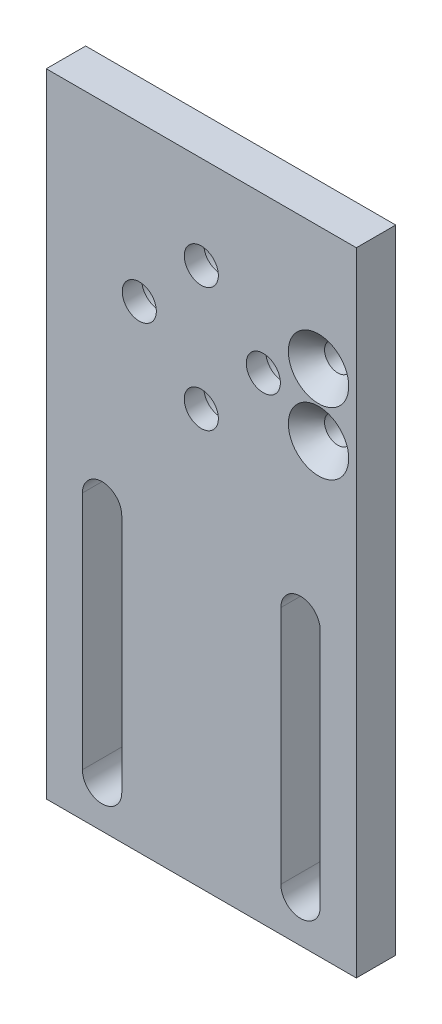
ISO-10303-21;
HEADER;
FILE_DESCRIPTION(('STEP AP214'),'2;1');
FILE_NAME('part.step','',(''),(''),'','','');
FILE_SCHEMA(('AUTOMOTIVE_DESIGN { 1 0 10303 214 1 1 1 1 }'));
ENDSEC;
DATA;
#1=APPLICATION_CONTEXT('core data for automotive mechanical design processes');
#2=APPLICATION_PROTOCOL_DEFINITION('international standard','automotive_design',2000,#1);
#3=PRODUCT_CONTEXT('',#1,'mechanical');
#4=PRODUCT('Part','Part','',(#3));
#5=PRODUCT_RELATED_PRODUCT_CATEGORY('part','',(#4));
#6=PRODUCT_DEFINITION_FORMATION('','',#4);
#7=PRODUCT_DEFINITION_CONTEXT('part definition',#1,'design');
#8=PRODUCT_DEFINITION('design','',#6,#7);
#9=PRODUCT_DEFINITION_SHAPE('','',#8);
#10=(LENGTH_UNIT() NAMED_UNIT(*) SI_UNIT(.MILLI.,.METRE.));
#11=(NAMED_UNIT(*) PLANE_ANGLE_UNIT() SI_UNIT($,.RADIAN.));
#12=(NAMED_UNIT(*) SI_UNIT($,.STERADIAN.) SOLID_ANGLE_UNIT());
#13=UNCERTAINTY_MEASURE_WITH_UNIT(LENGTH_MEASURE(1.E-05),#10,'distance_accuracy_value','');
#14=(GEOMETRIC_REPRESENTATION_CONTEXT(3) GLOBAL_UNCERTAINTY_ASSIGNED_CONTEXT((#13)) GLOBAL_UNIT_ASSIGNED_CONTEXT((#10,
#11,#12)) REPRESENTATION_CONTEXT('',''));
#15=CARTESIAN_POINT('',(0.,0.,0.));
#16=DIRECTION('',(0.,0.,1.));
#17=DIRECTION('',(1.,0.,0.));
#18=AXIS2_PLACEMENT_3D('',#15,#16,#17);
#19=CARTESIAN_POINT('',(-16.002,-69.9897,6.35));
#20=DIRECTION('',(0.,0.,-1.));
#21=DIRECTION('',(-1.,0.,0.));
#22=AXIS2_PLACEMENT_3D('',#19,#20,#21);
#23=CYLINDRICAL_SURFACE('',#22,3.175);
#24=CARTESIAN_POINT('',(-16.002,-69.9897,0.));
#25=DIRECTION('',(0.,0.,1.));
#26=DIRECTION('',(1.,0.,0.));
#27=AXIS2_PLACEMENT_3D('',#24,#25,#26);
#28=CIRCLE('',#27,3.175);
#29=CARTESIAN_POINT('',(-19.177,-69.9897,0.));
#30=VERTEX_POINT('',#29);
#31=CARTESIAN_POINT('',(-12.827,-69.9897,0.));
#32=VERTEX_POINT('',#31);
#33=EDGE_CURVE('E179',#30,#32,#28,.T.);
#34=ORIENTED_EDGE('',*,*,#33,.F.);
#35=DIRECTION('',(0.,0.,-1.));
#36=VECTOR('',#35,1.);
#37=CARTESIAN_POINT('',(-19.177,-69.9897,6.35));
#38=LINE('',#37,#36);
#39=CARTESIAN_POINT('',(-19.177,-69.9897,6.35));
#40=VERTEX_POINT('',#39);
#41=EDGE_CURVE('E11',#40,#30,#38,.T.);
#42=ORIENTED_EDGE('',*,*,#41,.F.);
#43=CARTESIAN_POINT('',(-16.002,-69.9897,6.35));
#44=DIRECTION('',(0.,0.,1.));
#45=DIRECTION('',(1.,0.,0.));
#46=AXIS2_PLACEMENT_3D('',#43,#44,#45);
#47=CIRCLE('',#46,3.175);
#48=CARTESIAN_POINT('',(-12.827,-69.9897,6.35));
#49=VERTEX_POINT('',#48);
#50=EDGE_CURVE('E148',#40,#49,#47,.T.);
#51=ORIENTED_EDGE('',*,*,#50,.T.);
#52=DIRECTION('',(0.,0.,-1.));
#53=VECTOR('',#52,1.);
#54=CARTESIAN_POINT('',(-12.827,-69.9897,6.35));
#55=LINE('',#54,#53);
#56=EDGE_CURVE('E101',#49,#32,#55,.T.);
#57=ORIENTED_EDGE('',*,*,#56,.T.);
#58=EDGE_LOOP('',(#34,#42,#51,#57));
#59=FACE_BOUND('',#58,.T.);
#60=ADVANCED_FACE('F36',(#59),#23,.F.);
#61=CARTESIAN_POINT('',(-19.177,0.,6.35));
#62=DIRECTION('',(1.,0.,0.));
#63=DIRECTION('',(0.,1.,0.));
#64=AXIS2_PLACEMENT_3D('',#61,#62,#63);
#65=PLANE('',#64);
#66=DIRECTION('',(0.,-1.,0.));
#67=VECTOR('',#66,1.);
#68=CARTESIAN_POINT('',(-19.177,0.,0.));
#69=LINE('',#68,#67);
#70=CARTESIAN_POINT('',(-19.177,-31.341450548398,0.));
#71=VERTEX_POINT('',#70);
#72=EDGE_CURVE('E140',#71,#30,#69,.T.);
#73=ORIENTED_EDGE('',*,*,#72,.F.);
#74=DIRECTION('',(0.,0.,-1.));
#75=VECTOR('',#74,1.);
#76=CARTESIAN_POINT('',(-19.177,-31.341450548398,6.35));
#77=LINE('',#76,#75);
#78=CARTESIAN_POINT('',(-19.177,-31.341450548398,6.35));
#79=VERTEX_POINT('',#78);
#80=EDGE_CURVE('E46',#79,#71,#77,.T.);
#81=ORIENTED_EDGE('',*,*,#80,.F.);
#82=DIRECTION('',(0.,-1.,0.));
#83=VECTOR('',#82,1.);
#84=CARTESIAN_POINT('',(-19.177,0.,6.35));
#85=LINE('',#84,#83);
#86=EDGE_CURVE('E138',#79,#40,#85,.T.);
#87=ORIENTED_EDGE('',*,*,#86,.T.);
#88=ORIENTED_EDGE('',*,*,#41,.T.);
#89=EDGE_LOOP('',(#73,#81,#87,#88));
#90=FACE_BOUND('',#89,.T.);
#91=ADVANCED_FACE('F137',(#90),#65,.T.);
#92=CARTESIAN_POINT('',(-16.002,-31.341450548398,6.35));
#93=DIRECTION('',(0.,0.,-1.));
#94=DIRECTION('',(-1.,0.,0.));
#95=AXIS2_PLACEMENT_3D('',#92,#93,#94);
#96=CYLINDRICAL_SURFACE('',#95,3.175);
#97=CARTESIAN_POINT('',(-16.002,-31.341450548398,0.));
#98=DIRECTION('',(0.,0.,1.));
#99=DIRECTION('',(1.,0.,0.));
#100=AXIS2_PLACEMENT_3D('',#97,#98,#99);
#101=CIRCLE('',#100,3.175);
#102=CARTESIAN_POINT('',(-12.827,-31.341450548398,0.));
#103=VERTEX_POINT('',#102);
#104=EDGE_CURVE('E183',#103,#71,#101,.T.);
#105=ORIENTED_EDGE('',*,*,#104,.F.);
#106=DIRECTION('',(0.,0.,-1.));
#107=VECTOR('',#106,1.);
#108=CARTESIAN_POINT('',(-12.827,-31.341450548398,6.35));
#109=LINE('',#108,#107);
#110=CARTESIAN_POINT('',(-12.827,-31.341450548398,6.35));
#111=VERTEX_POINT('',#110);
#112=EDGE_CURVE('E94',#111,#103,#109,.T.);
#113=ORIENTED_EDGE('',*,*,#112,.F.);
#114=CARTESIAN_POINT('',(-16.002,-31.341450548398,6.35));
#115=DIRECTION('',(0.,0.,1.));
#116=DIRECTION('',(1.,0.,0.));
#117=AXIS2_PLACEMENT_3D('',#114,#115,#116);
#118=CIRCLE('',#117,3.175);
#119=EDGE_CURVE('E147',#111,#79,#118,.T.);
#120=ORIENTED_EDGE('',*,*,#119,.T.);
#121=ORIENTED_EDGE('',*,*,#80,.T.);
#122=EDGE_LOOP('',(#105,#113,#120,#121));
#123=FACE_BOUND('',#122,.T.);
#124=ADVANCED_FACE('F150',(#123),#96,.F.);
#125=CARTESIAN_POINT('',(16.002,-69.9897,6.35));
#126=DIRECTION('',(0.,0.,-1.));
#127=DIRECTION('',(-1.,0.,0.));
#128=AXIS2_PLACEMENT_3D('',#125,#126,#127);
#129=CYLINDRICAL_SURFACE('',#128,3.175);
#130=CARTESIAN_POINT('',(16.002,-69.9897,0.));
#131=DIRECTION('',(0.,0.,1.));
#132=DIRECTION('',(1.,0.,0.));
#133=AXIS2_PLACEMENT_3D('',#130,#131,#132);
#134=CIRCLE('',#133,3.175);
#135=CARTESIAN_POINT('',(12.827,-69.9897,0.));
#136=VERTEX_POINT('',#135);
#137=CARTESIAN_POINT('',(19.177,-69.9897,0.));
#138=VERTEX_POINT('',#137);
#139=EDGE_CURVE('E167',#136,#138,#134,.T.);
#140=ORIENTED_EDGE('',*,*,#139,.F.);
#141=DIRECTION('',(0.,0.,-1.));
#142=VECTOR('',#141,1.);
#143=CARTESIAN_POINT('',(12.827,-69.9897,6.35));
#144=LINE('',#143,#142);
#145=CARTESIAN_POINT('',(12.827,-69.9897,6.35));
#146=VERTEX_POINT('',#145);
#147=EDGE_CURVE('E189',#146,#136,#144,.T.);
#148=ORIENTED_EDGE('',*,*,#147,.F.);
#149=CARTESIAN_POINT('',(16.002,-69.9897,6.35));
#150=DIRECTION('',(0.,0.,1.));
#151=DIRECTION('',(1.,0.,0.));
#152=AXIS2_PLACEMENT_3D('',#149,#150,#151);
#153=CIRCLE('',#152,3.175);
#154=CARTESIAN_POINT('',(19.177,-69.9897,6.35));
#155=VERTEX_POINT('',#154);
#156=EDGE_CURVE('E226',#146,#155,#153,.T.);
#157=ORIENTED_EDGE('',*,*,#156,.T.);
#158=DIRECTION('',(0.,0.,-1.));
#159=VECTOR('',#158,1.);
#160=CARTESIAN_POINT('',(19.177,-69.9897,6.35));
#161=LINE('',#160,#159);
#162=EDGE_CURVE('E191',#155,#138,#161,.T.);
#163=ORIENTED_EDGE('',*,*,#162,.T.);
#164=EDGE_LOOP('',(#140,#148,#157,#163));
#165=FACE_BOUND('',#164,.T.);
#166=ADVANCED_FACE('F271',(#165),#129,.F.);
#167=CARTESIAN_POINT('',(12.827,0.,6.35));
#168=DIRECTION('',(1.,0.,0.));
#169=DIRECTION('',(0.,1.,0.));
#170=AXIS2_PLACEMENT_3D('',#167,#168,#169);
#171=PLANE('',#170);
#172=DIRECTION('',(0.,-1.,0.));
#173=VECTOR('',#172,1.);
#174=CARTESIAN_POINT('',(12.827,0.,0.));
#175=LINE('',#174,#173);
#176=CARTESIAN_POINT('',(12.827,-31.341450548398,0.));
#177=VERTEX_POINT('',#176);
#178=EDGE_CURVE('E170',#177,#136,#175,.T.);
#179=ORIENTED_EDGE('',*,*,#178,.F.);
#180=DIRECTION('',(0.,0.,-1.));
#181=VECTOR('',#180,1.);
#182=CARTESIAN_POINT('',(12.827,-31.341450548398,6.35));
#183=LINE('',#182,#181);
#184=CARTESIAN_POINT('',(12.827,-31.341450548398,6.35));
#185=VERTEX_POINT('',#184);
#186=EDGE_CURVE('E195',#185,#177,#183,.T.);
#187=ORIENTED_EDGE('',*,*,#186,.F.);
#188=DIRECTION('',(0.,-1.,0.));
#189=VECTOR('',#188,1.);
#190=CARTESIAN_POINT('',(12.827,0.,6.35));
#191=LINE('',#190,#189);
#192=EDGE_CURVE('E233',#185,#146,#191,.T.);
#193=ORIENTED_EDGE('',*,*,#192,.T.);
#194=ORIENTED_EDGE('',*,*,#147,.T.);
#195=EDGE_LOOP('',(#179,#187,#193,#194));
#196=FACE_BOUND('',#195,.T.);
#197=ADVANCED_FACE('F267',(#196),#171,.T.);
#198=CARTESIAN_POINT('',(16.002,-31.341450548398,6.35));
#199=DIRECTION('',(0.,0.,-1.));
#200=DIRECTION('',(-1.,0.,0.));
#201=AXIS2_PLACEMENT_3D('',#198,#199,#200);
#202=CYLINDRICAL_SURFACE('',#201,3.175);
#203=CARTESIAN_POINT('',(16.002,-31.341450548398,0.));
#204=DIRECTION('',(0.,0.,1.));
#205=DIRECTION('',(1.,0.,0.));
#206=AXIS2_PLACEMENT_3D('',#203,#204,#205);
#207=CIRCLE('',#206,3.175);
#208=CARTESIAN_POINT('',(19.177,-31.341450548398,0.));
#209=VERTEX_POINT('',#208);
#210=EDGE_CURVE('E173',#209,#177,#207,.T.);
#211=ORIENTED_EDGE('',*,*,#210,.F.);
#212=DIRECTION('',(0.,0.,-1.));
#213=VECTOR('',#212,1.);
#214=CARTESIAN_POINT('',(19.177,-31.341450548398,6.35));
#215=LINE('',#214,#213);
#216=CARTESIAN_POINT('',(19.177,-31.341450548398,6.35));
#217=VERTEX_POINT('',#216);
#218=EDGE_CURVE('E193',#217,#209,#215,.T.);
#219=ORIENTED_EDGE('',*,*,#218,.F.);
#220=CARTESIAN_POINT('',(16.002,-31.341450548398,6.35));
#221=DIRECTION('',(0.,0.,1.));
#222=DIRECTION('',(1.,0.,0.));
#223=AXIS2_PLACEMENT_3D('',#220,#221,#222);
#224=CIRCLE('',#223,3.175);
#225=EDGE_CURVE('E236',#217,#185,#224,.T.);
#226=ORIENTED_EDGE('',*,*,#225,.T.);
#227=ORIENTED_EDGE('',*,*,#186,.T.);
#228=EDGE_LOOP('',(#211,#219,#226,#227));
#229=FACE_BOUND('',#228,.T.);
#230=ADVANCED_FACE('F264',(#229),#202,.F.);
#231=CARTESIAN_POINT('',(-24.9999999999998,0.,6.35));
#232=DIRECTION('',(-1.,0.,0.));
#233=DIRECTION('',(0.,0.,1.));
#234=AXIS2_PLACEMENT_3D('',#231,#232,#233);
#235=PLANE('',#234);
#236=DIRECTION('',(0.,1.,0.));
#237=VECTOR('',#236,1.);
#238=CARTESIAN_POINT('',(-24.9999999999998,0.,0.));
#239=LINE('',#238,#237);
#240=CARTESIAN_POINT('',(-24.9999999999998,-76.9874,0.));
#241=VERTEX_POINT('',#240);
#242=CARTESIAN_POINT('',(-24.9999999999998,25.0000000000001,0.));
#243=VERTEX_POINT('',#242);
#244=EDGE_CURVE('E156',#241,#243,#239,.T.);
#245=ORIENTED_EDGE('',*,*,#244,.F.);
#246=DIRECTION('',(0.,0.,-1.));
#247=VECTOR('',#246,1.);
#248=CARTESIAN_POINT('',(-24.9999999999998,-76.9874,6.35));
#249=LINE('',#248,#247);
#250=CARTESIAN_POINT('',(-24.9999999999998,-76.9874,6.35));
#251=VERTEX_POINT('',#250);
#252=EDGE_CURVE('E40',#251,#241,#249,.T.);
#253=ORIENTED_EDGE('',*,*,#252,.F.);
#254=DIRECTION('',(0.,1.,0.));
#255=VECTOR('',#254,1.);
#256=CARTESIAN_POINT('',(-24.9999999999998,0.,6.35));
#257=LINE('',#256,#255);
#258=CARTESIAN_POINT('',(-24.9999999999998,25.0000000000001,6.35));
#259=VERTEX_POINT('',#258);
#260=EDGE_CURVE('E187',#251,#259,#257,.T.);
#261=ORIENTED_EDGE('',*,*,#260,.T.);
#262=DIRECTION('',(0.,0.,-1.));
#263=VECTOR('',#262,1.);
#264=CARTESIAN_POINT('',(-24.9999999999998,25.0000000000001,6.35));
#265=LINE('',#264,#263);
#266=EDGE_CURVE('E152',#259,#243,#265,.T.);
#267=ORIENTED_EDGE('',*,*,#266,.T.);
#268=EDGE_LOOP('',(#245,#253,#261,#267));
#269=FACE_BOUND('',#268,.T.);
#270=ADVANCED_FACE('F38',(#269),#235,.T.);
#271=CARTESIAN_POINT('',(0.,-76.9874,6.35));
#272=DIRECTION('',(0.,1.,0.));
#273=DIRECTION('',(0.,0.,1.));
#274=AXIS2_PLACEMENT_3D('',#271,#272,#273);
#275=PLANE('',#274);
#276=DIRECTION('',(1.,0.,0.));
#277=VECTOR('',#276,1.);
#278=CARTESIAN_POINT('',(0.,-76.9874,0.));
#279=LINE('',#278,#277);
#280=CARTESIAN_POINT('',(25.0000000000002,-76.9874,0.));
#281=VERTEX_POINT('',#280);
#282=EDGE_CURVE('E159',#241,#281,#279,.T.);
#283=ORIENTED_EDGE('',*,*,#282,.T.);
#284=DIRECTION('',(0.,0.,-1.));
#285=VECTOR('',#284,1.);
#286=CARTESIAN_POINT('',(25.0000000000002,-76.9874,6.35));
#287=LINE('',#286,#285);
#288=CARTESIAN_POINT('',(25.0000000000002,-76.9874,6.35));
#289=VERTEX_POINT('',#288);
#290=EDGE_CURVE('E201',#289,#281,#287,.T.);
#291=ORIENTED_EDGE('',*,*,#290,.F.);
#292=DIRECTION('',(1.,0.,0.));
#293=VECTOR('',#292,1.);
#294=CARTESIAN_POINT('',(0.,-76.9874,6.35));
#295=LINE('',#294,#293);
#296=EDGE_CURVE('E210',#251,#289,#295,.T.);
#297=ORIENTED_EDGE('',*,*,#296,.F.);
#298=ORIENTED_EDGE('',*,*,#252,.T.);
#299=EDGE_LOOP('',(#283,#291,#297,#298));
#300=FACE_BOUND('',#299,.T.);
#301=ADVANCED_FACE('F209',(#300),#275,.F.);
#302=CARTESIAN_POINT('',(25.0000000000002,0.,6.35));
#303=DIRECTION('',(-1.,0.,0.));
#304=DIRECTION('',(0.,0.,1.));
#305=AXIS2_PLACEMENT_3D('',#302,#303,#304);
#306=PLANE('',#305);
#307=DIRECTION('',(0.,1.,0.));
#308=VECTOR('',#307,1.);
#309=CARTESIAN_POINT('',(25.0000000000002,0.,0.));
#310=LINE('',#309,#308);
#311=CARTESIAN_POINT('',(25.0000000000002,25.0000000000002,0.));
#312=VERTEX_POINT('',#311);
#313=EDGE_CURVE('E162',#281,#312,#310,.T.);
#314=ORIENTED_EDGE('',*,*,#313,.T.);
#315=DIRECTION('',(0.,0.,-1.));
#316=VECTOR('',#315,1.);
#317=CARTESIAN_POINT('',(25.0000000000002,25.0000000000002,6.35));
#318=LINE('',#317,#316);
#319=CARTESIAN_POINT('',(25.0000000000002,25.0000000000002,6.35));
#320=VERTEX_POINT('',#319);
#321=EDGE_CURVE('E199',#320,#312,#318,.T.);
#322=ORIENTED_EDGE('',*,*,#321,.F.);
#323=DIRECTION('',(0.,1.,0.));
#324=VECTOR('',#323,1.);
#325=CARTESIAN_POINT('',(25.0000000000002,0.,6.35));
#326=LINE('',#325,#324);
#327=EDGE_CURVE('E223',#289,#320,#326,.T.);
#328=ORIENTED_EDGE('',*,*,#327,.F.);
#329=ORIENTED_EDGE('',*,*,#290,.T.);
#330=EDGE_LOOP('',(#314,#322,#328,#329));
#331=FACE_BOUND('',#330,.T.);
#332=ADVANCED_FACE('F222',(#331),#306,.F.);
#333=CARTESIAN_POINT('',(19.177,0.,6.35));
#334=DIRECTION('',(1.,0.,0.));
#335=DIRECTION('',(0.,1.,0.));
#336=AXIS2_PLACEMENT_3D('',#333,#334,#335);
#337=PLANE('',#336);
#338=DIRECTION('',(0.,-1.,0.));
#339=VECTOR('',#338,1.);
#340=CARTESIAN_POINT('',(19.177,0.,0.));
#341=LINE('',#340,#339);
#342=EDGE_CURVE('E176',#209,#138,#341,.T.);
#343=ORIENTED_EDGE('',*,*,#342,.T.);
#344=ORIENTED_EDGE('',*,*,#162,.F.);
#345=DIRECTION('',(0.,-1.,0.));
#346=VECTOR('',#345,1.);
#347=CARTESIAN_POINT('',(19.177,0.,6.35));
#348=LINE('',#347,#346);
#349=EDGE_CURVE('E239',#217,#155,#348,.T.);
#350=ORIENTED_EDGE('',*,*,#349,.F.);
#351=ORIENTED_EDGE('',*,*,#218,.T.);
#352=EDGE_LOOP('',(#343,#344,#350,#351));
#353=FACE_BOUND('',#352,.T.);
#354=ADVANCED_FACE('F250',(#353),#337,.F.);
#355=CARTESIAN_POINT('',(0.,25.0000000000002,6.35));
#356=DIRECTION('',(0.,-1.,0.));
#357=DIRECTION('',(1.,0.,0.));
#358=AXIS2_PLACEMENT_3D('',#355,#356,#357);
#359=PLANE('',#358);
#360=DIRECTION('',(-1.,0.,0.));
#361=VECTOR('',#360,1.);
#362=CARTESIAN_POINT('',(0.,25.0000000000002,0.));
#363=LINE('',#362,#361);
#364=EDGE_CURVE('E164',#312,#243,#363,.T.);
#365=ORIENTED_EDGE('',*,*,#364,.T.);
#366=ORIENTED_EDGE('',*,*,#266,.F.);
#367=DIRECTION('',(-1.,0.,0.));
#368=VECTOR('',#367,1.);
#369=CARTESIAN_POINT('',(0.,25.0000000000002,6.35));
#370=LINE('',#369,#368);
#371=EDGE_CURVE('E221',#320,#259,#370,.T.);
#372=ORIENTED_EDGE('',*,*,#371,.F.);
#373=ORIENTED_EDGE('',*,*,#321,.T.);
#374=EDGE_LOOP('',(#365,#366,#372,#373));
#375=FACE_BOUND('',#374,.T.);
#376=ADVANCED_FACE('F219',(#375),#359,.F.);
#377=CARTESIAN_POINT('',(-12.827,0.,6.35));
#378=DIRECTION('',(1.,0.,0.));
#379=DIRECTION('',(0.,1.,0.));
#380=AXIS2_PLACEMENT_3D('',#377,#378,#379);
#381=PLANE('',#380);
#382=DIRECTION('',(0.,-1.,0.));
#383=VECTOR('',#382,1.);
#384=CARTESIAN_POINT('',(-12.827,0.,0.));
#385=LINE('',#384,#383);
#386=EDGE_CURVE('E185',#103,#32,#385,.T.);
#387=ORIENTED_EDGE('',*,*,#386,.T.);
#388=ORIENTED_EDGE('',*,*,#56,.F.);
#389=DIRECTION('',(0.,-1.,0.));
#390=VECTOR('',#389,1.);
#391=CARTESIAN_POINT('',(-12.827,0.,6.35));
#392=LINE('',#391,#390);
#393=EDGE_CURVE('E55',#111,#49,#392,.T.);
#394=ORIENTED_EDGE('',*,*,#393,.F.);
#395=ORIENTED_EDGE('',*,*,#112,.T.);
#396=EDGE_LOOP('',(#387,#388,#394,#395));
#397=FACE_BOUND('',#396,.T.);
#398=ADVANCED_FACE('F241',(#397),#381,.F.);
#399=CARTESIAN_POINT('',(0.,0.,6.35));
#400=DIRECTION('',(0.,0.,1.));
#401=DIRECTION('',(1.,0.,0.));
#402=AXIS2_PLACEMENT_3D('',#399,#400,#401);
#403=PLANE('',#402);
#404=CARTESIAN_POINT('',(0.,10.,6.35));
#405=DIRECTION('',(0.,0.,-1.));
#406=DIRECTION('',(-1.,0.,0.));
#407=AXIS2_PLACEMENT_3D('',#404,#405,#406);
#408=CIRCLE('',#407,2.75);
#409=CARTESIAN_POINT('',(-2.75,10.,6.35));
#410=VERTEX_POINT('',#409);
#411=EDGE_CURVE('E544',#410,#410,#408,.T.);
#412=ORIENTED_EDGE('',*,*,#411,.T.);
#413=EDGE_LOOP('',(#412));
#414=FACE_BOUND('',#413,.T.);
#415=CARTESIAN_POINT('',(10.,0.,6.35));
#416=DIRECTION('',(0.,0.,-1.));
#417=DIRECTION('',(-1.,0.,0.));
#418=AXIS2_PLACEMENT_3D('',#415,#416,#417);
#419=CIRCLE('',#418,2.75);
#420=CARTESIAN_POINT('',(7.25,0.,6.35));
#421=VERTEX_POINT('',#420);
#422=EDGE_CURVE('E556',#421,#421,#419,.T.);
#423=ORIENTED_EDGE('',*,*,#422,.T.);
#424=EDGE_LOOP('',(#423));
#425=FACE_BOUND('',#424,.T.);
#426=CARTESIAN_POINT('',(0.,-10.,6.35));
#427=DIRECTION('',(0.,0.,-1.));
#428=DIRECTION('',(-1.,0.,0.));
#429=AXIS2_PLACEMENT_3D('',#426,#427,#428);
#430=CIRCLE('',#429,2.75);
#431=CARTESIAN_POINT('',(-2.75,-10.,6.35));
#432=VERTEX_POINT('',#431);
#433=EDGE_CURVE('E568',#432,#432,#430,.T.);
#434=ORIENTED_EDGE('',*,*,#433,.T.);
#435=EDGE_LOOP('',(#434));
#436=FACE_BOUND('',#435,.T.);
#437=CARTESIAN_POINT('',(-10.,0.,6.35));
#438=DIRECTION('',(0.,0.,-1.));
#439=DIRECTION('',(-1.,0.,0.));
#440=AXIS2_PLACEMENT_3D('',#437,#438,#439);
#441=CIRCLE('',#440,2.75);
#442=CARTESIAN_POINT('',(-12.75,0.,6.35));
#443=VERTEX_POINT('',#442);
#444=EDGE_CURVE('E580',#443,#443,#441,.T.);
#445=ORIENTED_EDGE('',*,*,#444,.T.);
#446=EDGE_LOOP('',(#445));
#447=FACE_BOUND('',#446,.T.);
#448=CARTESIAN_POINT('',(18.9040000000002,5.04825,6.35));
#449=DIRECTION('',(0.,0.,1.));
#450=DIRECTION('',(1.,0.,0.));
#451=AXIS2_PLACEMENT_3D('',#448,#449,#450);
#452=CIRCLE('',#451,4.8680878);
#453=CARTESIAN_POINT('',(23.7720878000002,5.04825,6.35));
#454=VERTEX_POINT('',#453);
#455=EDGE_CURVE('E583',#454,#454,#452,.T.);
#456=ORIENTED_EDGE('',*,*,#455,.F.);
#457=EDGE_LOOP('',(#456));
#458=FACE_BOUND('',#457,.T.);
#459=CARTESIAN_POINT('',(18.9040000000002,-5.04825,6.35));
#460=DIRECTION('',(0.,0.,1.));
#461=DIRECTION('',(1.,0.,0.));
#462=AXIS2_PLACEMENT_3D('',#459,#460,#461);
#463=CIRCLE('',#462,4.8680878);
#464=CARTESIAN_POINT('',(23.7720878000002,-5.04825,6.35));
#465=VERTEX_POINT('',#464);
#466=EDGE_CURVE('E592',#465,#465,#463,.T.);
#467=ORIENTED_EDGE('',*,*,#466,.F.);
#468=EDGE_LOOP('',(#467));
#469=FACE_BOUND('',#468,.T.);
#470=ORIENTED_EDGE('',*,*,#260,.F.);
#471=ORIENTED_EDGE('',*,*,#296,.T.);
#472=ORIENTED_EDGE('',*,*,#327,.T.);
#473=ORIENTED_EDGE('',*,*,#371,.T.);
#474=EDGE_LOOP('',(#470,#471,#472,#473));
#475=FACE_BOUND('',#474,.T.);
#476=ORIENTED_EDGE('',*,*,#156,.F.);
#477=ORIENTED_EDGE('',*,*,#192,.F.);
#478=ORIENTED_EDGE('',*,*,#225,.F.);
#479=ORIENTED_EDGE('',*,*,#349,.T.);
#480=EDGE_LOOP('',(#476,#477,#478,#479));
#481=FACE_BOUND('',#480,.T.);
#482=ORIENTED_EDGE('',*,*,#50,.F.);
#483=ORIENTED_EDGE('',*,*,#86,.F.);
#484=ORIENTED_EDGE('',*,*,#119,.F.);
#485=ORIENTED_EDGE('',*,*,#393,.T.);
#486=EDGE_LOOP('',(#482,#483,#484,#485));
#487=FACE_BOUND('',#486,.T.);
#488=ADVANCED_FACE('F146',(#414,#425,#436,#447,#458,#469,#475,#481,#487),#403,.T.);
#489=CARTESIAN_POINT('',(0.,0.,0.));
#490=DIRECTION('',(0.,0.,1.));
#491=DIRECTION('',(1.,0.,0.));
#492=AXIS2_PLACEMENT_3D('',#489,#490,#491);
#493=PLANE('',#492);
#494=CARTESIAN_POINT('',(0.,10.,0.));
#495=DIRECTION('',(0.,0.,-1.));
#496=DIRECTION('',(-1.,0.,0.));
#497=AXIS2_PLACEMENT_3D('',#494,#495,#496);
#498=CIRCLE('',#497,4.99999999999999);
#499=CARTESIAN_POINT('',(-4.99999999999999,10.,0.));
#500=VERTEX_POINT('',#499);
#501=EDGE_CURVE('E537',#500,#500,#498,.T.);
#502=ORIENTED_EDGE('',*,*,#501,.F.);
#503=EDGE_LOOP('',(#502));
#504=FACE_BOUND('',#503,.T.);
#505=CARTESIAN_POINT('',(10.,0.,0.));
#506=DIRECTION('',(0.,0.,-1.));
#507=DIRECTION('',(-1.,0.,0.));
#508=AXIS2_PLACEMENT_3D('',#505,#506,#507);
#509=CIRCLE('',#508,4.99999999999999);
#510=CARTESIAN_POINT('',(5.,0.,0.));
#511=VERTEX_POINT('',#510);
#512=EDGE_CURVE('E547',#511,#511,#509,.T.);
#513=ORIENTED_EDGE('',*,*,#512,.F.);
#514=EDGE_LOOP('',(#513));
#515=FACE_BOUND('',#514,.T.);
#516=CARTESIAN_POINT('',(0.,-10.,0.));
#517=DIRECTION('',(0.,0.,-1.));
#518=DIRECTION('',(-1.,0.,0.));
#519=AXIS2_PLACEMENT_3D('',#516,#517,#518);
#520=CIRCLE('',#519,4.99999999999999);
#521=CARTESIAN_POINT('',(-5.,-10.,0.));
#522=VERTEX_POINT('',#521);
#523=EDGE_CURVE('E559',#522,#522,#520,.T.);
#524=ORIENTED_EDGE('',*,*,#523,.F.);
#525=EDGE_LOOP('',(#524));
#526=FACE_BOUND('',#525,.T.);
#527=CARTESIAN_POINT('',(-10.,0.,0.));
#528=DIRECTION('',(0.,0.,-1.));
#529=DIRECTION('',(-1.,0.,0.));
#530=AXIS2_PLACEMENT_3D('',#527,#528,#529);
#531=CIRCLE('',#530,4.99999999999999);
#532=CARTESIAN_POINT('',(-15.,0.,0.));
#533=VERTEX_POINT('',#532);
#534=EDGE_CURVE('E571',#533,#533,#531,.T.);
#535=ORIENTED_EDGE('',*,*,#534,.F.);
#536=EDGE_LOOP('',(#535));
#537=FACE_BOUND('',#536,.T.);
#538=CARTESIAN_POINT('',(18.9040000000002,5.04825,0.));
#539=DIRECTION('',(0.,0.,1.));
#540=DIRECTION('',(1.,0.,0.));
#541=AXIS2_PLACEMENT_3D('',#538,#539,#540);
#542=CIRCLE('',#541,2.15265);
#543=CARTESIAN_POINT('',(21.0566500000002,5.04825,0.));
#544=VERTEX_POINT('',#543);
#545=EDGE_CURVE('E589',#544,#544,#542,.T.);
#546=ORIENTED_EDGE('',*,*,#545,.T.);
#547=EDGE_LOOP('',(#546));
#548=FACE_BOUND('',#547,.T.);
#549=CARTESIAN_POINT('',(18.9040000000002,-5.04825,0.));
#550=DIRECTION('',(0.,0.,1.));
#551=DIRECTION('',(1.,0.,0.));
#552=AXIS2_PLACEMENT_3D('',#549,#550,#551);
#553=CIRCLE('',#552,2.15265);
#554=CARTESIAN_POINT('',(21.0566500000002,-5.04825,0.));
#555=VERTEX_POINT('',#554);
#556=EDGE_CURVE('E160',#555,#555,#553,.T.);
#557=ORIENTED_EDGE('',*,*,#556,.T.);
#558=EDGE_LOOP('',(#557));
#559=FACE_BOUND('',#558,.T.);
#560=ORIENTED_EDGE('',*,*,#244,.T.);
#561=ORIENTED_EDGE('',*,*,#364,.F.);
#562=ORIENTED_EDGE('',*,*,#313,.F.);
#563=ORIENTED_EDGE('',*,*,#282,.F.);
#564=EDGE_LOOP('',(#560,#561,#562,#563));
#565=FACE_BOUND('',#564,.T.);
#566=ORIENTED_EDGE('',*,*,#139,.T.);
#567=ORIENTED_EDGE('',*,*,#342,.F.);
#568=ORIENTED_EDGE('',*,*,#210,.T.);
#569=ORIENTED_EDGE('',*,*,#178,.T.);
#570=EDGE_LOOP('',(#566,#567,#568,#569));
#571=FACE_BOUND('',#570,.T.);
#572=ORIENTED_EDGE('',*,*,#33,.T.);
#573=ORIENTED_EDGE('',*,*,#386,.F.);
#574=ORIENTED_EDGE('',*,*,#104,.T.);
#575=ORIENTED_EDGE('',*,*,#72,.T.);
#576=EDGE_LOOP('',(#572,#573,#574,#575));
#577=FACE_BOUND('',#576,.T.);
#578=ADVANCED_FACE('F213',(#504,#515,#526,#537,#548,#559,#565,#571,#577),#493,.F.);
#579=CARTESIAN_POINT('',(18.9040000000002,-5.04825,6.35));
#580=DIRECTION('',(0.,0.,1.));
#581=DIRECTION('',(1.,0.,0.));
#582=AXIS2_PLACEMENT_3D('',#579,#580,#581);
#583=CYLINDRICAL_SURFACE('',#582,2.15265);
#584=ORIENTED_EDGE('',*,*,#556,.F.);
#585=EDGE_LOOP('',(#584));
#586=FACE_BOUND('',#585,.T.);
#587=CARTESIAN_POINT('',(18.9040000000002,-5.04825,3.22624614310627));
#588=DIRECTION('',(0.,0.,1.));
#589=DIRECTION('',(1.,0.,0.));
#590=AXIS2_PLACEMENT_3D('',#587,#588,#589);
#591=CIRCLE('',#590,2.15265);
#592=CARTESIAN_POINT('',(21.0566500000002,-5.04825,3.22624614310627));
#593=VERTEX_POINT('',#592);
#594=EDGE_CURVE('E595',#593,#593,#591,.T.);
#595=ORIENTED_EDGE('',*,*,#594,.T.);
#596=EDGE_LOOP('',(#595));
#597=FACE_BOUND('',#596,.T.);
#598=ADVANCED_FACE('F367',(#586,#597),#583,.F.);
#599=CARTESIAN_POINT('',(18.9040000000002,-5.04825,6.35));
#600=DIRECTION('',(0.,0.,1.));
#601=DIRECTION('',(1.,0.,0.));
#602=AXIS2_PLACEMENT_3D('',#599,#600,#601);
#603=CONICAL_SURFACE('',#602,4.8680878,0.715584993317675);
#604=ORIENTED_EDGE('',*,*,#594,.F.);
#605=EDGE_LOOP('',(#604));
#606=FACE_BOUND('',#605,.T.);
#607=ORIENTED_EDGE('',*,*,#466,.T.);
#608=EDGE_LOOP('',(#607));
#609=FACE_BOUND('',#608,.T.);
#610=ADVANCED_FACE('F378',(#606,#609),#603,.F.);
#611=CARTESIAN_POINT('',(18.9040000000002,5.04825,6.35));
#612=DIRECTION('',(0.,0.,1.));
#613=DIRECTION('',(1.,0.,0.));
#614=AXIS2_PLACEMENT_3D('',#611,#612,#613);
#615=CYLINDRICAL_SURFACE('',#614,2.15265);
#616=ORIENTED_EDGE('',*,*,#545,.F.);
#617=EDGE_LOOP('',(#616));
#618=FACE_BOUND('',#617,.T.);
#619=CARTESIAN_POINT('',(18.9040000000002,5.04825,3.22624614310627));
#620=DIRECTION('',(0.,0.,1.));
#621=DIRECTION('',(1.,0.,0.));
#622=AXIS2_PLACEMENT_3D('',#619,#620,#621);
#623=CIRCLE('',#622,2.15265);
#624=CARTESIAN_POINT('',(21.0566500000002,5.04825,3.22624614310627));
#625=VERTEX_POINT('',#624);
#626=EDGE_CURVE('E586',#625,#625,#623,.T.);
#627=ORIENTED_EDGE('',*,*,#626,.T.);
#628=EDGE_LOOP('',(#627));
#629=FACE_BOUND('',#628,.T.);
#630=ADVANCED_FACE('F387',(#618,#629),#615,.F.);
#631=CARTESIAN_POINT('',(18.9040000000002,5.04825,6.35));
#632=DIRECTION('',(0.,0.,1.));
#633=DIRECTION('',(1.,0.,0.));
#634=AXIS2_PLACEMENT_3D('',#631,#632,#633);
#635=CONICAL_SURFACE('',#634,4.8680878,0.715584993317675);
#636=ORIENTED_EDGE('',*,*,#626,.F.);
#637=EDGE_LOOP('',(#636));
#638=FACE_BOUND('',#637,.T.);
#639=ORIENTED_EDGE('',*,*,#455,.T.);
#640=EDGE_LOOP('',(#639));
#641=FACE_BOUND('',#640,.T.);
#642=ADVANCED_FACE('F396',(#638,#641),#635,.F.);
#643=CARTESIAN_POINT('',(-10.,0.,0.));
#644=DIRECTION('',(0.,0.,-1.));
#645=DIRECTION('',(-1.,0.,0.));
#646=AXIS2_PLACEMENT_3D('',#643,#644,#645);
#647=CYLINDRICAL_SURFACE('',#646,2.75);
#648=ORIENTED_EDGE('',*,*,#444,.F.);
#649=EDGE_LOOP('',(#648));
#650=FACE_BOUND('',#649,.T.);
#651=CARTESIAN_POINT('',(-10.,0.,3.2));
#652=DIRECTION('',(0.,0.,-1.));
#653=DIRECTION('',(-1.,0.,0.));
#654=AXIS2_PLACEMENT_3D('',#651,#652,#653);
#655=CIRCLE('',#654,2.75);
#656=CARTESIAN_POINT('',(-12.75,0.,3.2));
#657=VERTEX_POINT('',#656);
#658=EDGE_CURVE('E577',#657,#657,#655,.T.);
#659=ORIENTED_EDGE('',*,*,#658,.T.);
#660=EDGE_LOOP('',(#659));
#661=FACE_BOUND('',#660,.T.);
#662=ADVANCED_FACE('F404',(#650,#661),#647,.F.);
#663=CARTESIAN_POINT('',(-7.25,0.,3.2));
#664=DIRECTION('',(0.,0.,1.));
#665=DIRECTION('',(1.,0.,0.));
#666=AXIS2_PLACEMENT_3D('',#663,#664,#665);
#667=PLANE('',#666);
#668=ORIENTED_EDGE('',*,*,#658,.F.);
#669=EDGE_LOOP('',(#668));
#670=FACE_BOUND('',#669,.T.);
#671=CARTESIAN_POINT('',(-10.,0.,3.2));
#672=DIRECTION('',(0.,0.,-1.));
#673=DIRECTION('',(-1.,0.,0.));
#674=AXIS2_PLACEMENT_3D('',#671,#672,#673);
#675=CIRCLE('',#674,5.);
#676=CARTESIAN_POINT('',(-15.,0.,3.2));
#677=VERTEX_POINT('',#676);
#678=EDGE_CURVE('E574',#677,#677,#675,.T.);
#679=ORIENTED_EDGE('',*,*,#678,.T.);
#680=EDGE_LOOP('',(#679));
#681=FACE_BOUND('',#680,.T.);
#682=ADVANCED_FACE('F412',(#670,#681),#667,.F.);
#683=CARTESIAN_POINT('',(-10.,0.,0.));
#684=DIRECTION('',(0.,0.,-1.));
#685=DIRECTION('',(-1.,0.,0.));
#686=AXIS2_PLACEMENT_3D('',#683,#684,#685);
#687=CYLINDRICAL_SURFACE('',#686,5.);
#688=ORIENTED_EDGE('',*,*,#678,.F.);
#689=EDGE_LOOP('',(#688));
#690=FACE_BOUND('',#689,.T.);
#691=ORIENTED_EDGE('',*,*,#534,.T.);
#692=EDGE_LOOP('',(#691));
#693=FACE_BOUND('',#692,.T.);
#694=ADVANCED_FACE('F421',(#690,#693),#687,.F.);
#695=CARTESIAN_POINT('',(0.,-10.,0.));
#696=DIRECTION('',(0.,0.,-1.));
#697=DIRECTION('',(-1.,0.,0.));
#698=AXIS2_PLACEMENT_3D('',#695,#696,#697);
#699=CYLINDRICAL_SURFACE('',#698,2.75);
#700=ORIENTED_EDGE('',*,*,#433,.F.);
#701=EDGE_LOOP('',(#700));
#702=FACE_BOUND('',#701,.T.);
#703=CARTESIAN_POINT('',(0.,-10.,3.2));
#704=DIRECTION('',(0.,0.,-1.));
#705=DIRECTION('',(-1.,0.,0.));
#706=AXIS2_PLACEMENT_3D('',#703,#704,#705);
#707=CIRCLE('',#706,2.75);
#708=CARTESIAN_POINT('',(-2.75,-10.,3.2));
#709=VERTEX_POINT('',#708);
#710=EDGE_CURVE('E565',#709,#709,#707,.T.);
#711=ORIENTED_EDGE('',*,*,#710,.T.);
#712=EDGE_LOOP('',(#711));
#713=FACE_BOUND('',#712,.T.);
#714=ADVANCED_FACE('F430',(#702,#713),#699,.F.);
#715=CARTESIAN_POINT('',(2.75,-10.,3.2));
#716=DIRECTION('',(0.,0.,1.));
#717=DIRECTION('',(1.,0.,0.));
#718=AXIS2_PLACEMENT_3D('',#715,#716,#717);
#719=PLANE('',#718);
#720=ORIENTED_EDGE('',*,*,#710,.F.);
#721=EDGE_LOOP('',(#720));
#722=FACE_BOUND('',#721,.T.);
#723=CARTESIAN_POINT('',(0.,-10.,3.2));
#724=DIRECTION('',(0.,0.,-1.));
#725=DIRECTION('',(-1.,0.,0.));
#726=AXIS2_PLACEMENT_3D('',#723,#724,#725);
#727=CIRCLE('',#726,5.);
#728=CARTESIAN_POINT('',(-5.,-10.,3.2));
#729=VERTEX_POINT('',#728);
#730=EDGE_CURVE('E562',#729,#729,#727,.T.);
#731=ORIENTED_EDGE('',*,*,#730,.T.);
#732=EDGE_LOOP('',(#731));
#733=FACE_BOUND('',#732,.T.);
#734=ADVANCED_FACE('F439',(#722,#733),#719,.F.);
#735=CARTESIAN_POINT('',(0.,-10.,0.));
#736=DIRECTION('',(0.,0.,-1.));
#737=DIRECTION('',(-1.,0.,0.));
#738=AXIS2_PLACEMENT_3D('',#735,#736,#737);
#739=CYLINDRICAL_SURFACE('',#738,5.);
#740=ORIENTED_EDGE('',*,*,#730,.F.);
#741=EDGE_LOOP('',(#740));
#742=FACE_BOUND('',#741,.T.);
#743=ORIENTED_EDGE('',*,*,#523,.T.);
#744=EDGE_LOOP('',(#743));
#745=FACE_BOUND('',#744,.T.);
#746=ADVANCED_FACE('F448',(#742,#745),#739,.F.);
#747=CARTESIAN_POINT('',(10.,0.,0.));
#748=DIRECTION('',(0.,0.,-1.));
#749=DIRECTION('',(-1.,0.,0.));
#750=AXIS2_PLACEMENT_3D('',#747,#748,#749);
#751=CYLINDRICAL_SURFACE('',#750,2.75);
#752=ORIENTED_EDGE('',*,*,#422,.F.);
#753=EDGE_LOOP('',(#752));
#754=FACE_BOUND('',#753,.T.);
#755=CARTESIAN_POINT('',(10.,0.,3.2));
#756=DIRECTION('',(0.,0.,-1.));
#757=DIRECTION('',(-1.,0.,0.));
#758=AXIS2_PLACEMENT_3D('',#755,#756,#757);
#759=CIRCLE('',#758,2.75);
#760=CARTESIAN_POINT('',(7.25,0.,3.2));
#761=VERTEX_POINT('',#760);
#762=EDGE_CURVE('E553',#761,#761,#759,.T.);
#763=ORIENTED_EDGE('',*,*,#762,.T.);
#764=EDGE_LOOP('',(#763));
#765=FACE_BOUND('',#764,.T.);
#766=ADVANCED_FACE('F457',(#754,#765),#751,.F.);
#767=CARTESIAN_POINT('',(12.75,0.,3.2));
#768=DIRECTION('',(0.,0.,1.));
#769=DIRECTION('',(1.,0.,0.));
#770=AXIS2_PLACEMENT_3D('',#767,#768,#769);
#771=PLANE('',#770);
#772=ORIENTED_EDGE('',*,*,#762,.F.);
#773=EDGE_LOOP('',(#772));
#774=FACE_BOUND('',#773,.T.);
#775=CARTESIAN_POINT('',(10.,0.,3.2));
#776=DIRECTION('',(0.,0.,-1.));
#777=DIRECTION('',(-1.,0.,0.));
#778=AXIS2_PLACEMENT_3D('',#775,#776,#777);
#779=CIRCLE('',#778,5.);
#780=CARTESIAN_POINT('',(5.,0.,3.2));
#781=VERTEX_POINT('',#780);
#782=EDGE_CURVE('E550',#781,#781,#779,.T.);
#783=ORIENTED_EDGE('',*,*,#782,.T.);
#784=EDGE_LOOP('',(#783));
#785=FACE_BOUND('',#784,.T.);
#786=ADVANCED_FACE('F466',(#774,#785),#771,.F.);
#787=CARTESIAN_POINT('',(10.,0.,0.));
#788=DIRECTION('',(0.,0.,-1.));
#789=DIRECTION('',(-1.,0.,0.));
#790=AXIS2_PLACEMENT_3D('',#787,#788,#789);
#791=CYLINDRICAL_SURFACE('',#790,5.);
#792=ORIENTED_EDGE('',*,*,#782,.F.);
#793=EDGE_LOOP('',(#792));
#794=FACE_BOUND('',#793,.T.);
#795=ORIENTED_EDGE('',*,*,#512,.T.);
#796=EDGE_LOOP('',(#795));
#797=FACE_BOUND('',#796,.T.);
#798=ADVANCED_FACE('F475',(#794,#797),#791,.F.);
#799=CARTESIAN_POINT('',(0.,10.,0.));
#800=DIRECTION('',(0.,0.,-1.));
#801=DIRECTION('',(-1.,0.,0.));
#802=AXIS2_PLACEMENT_3D('',#799,#800,#801);
#803=CYLINDRICAL_SURFACE('',#802,2.75);
#804=ORIENTED_EDGE('',*,*,#411,.F.);
#805=EDGE_LOOP('',(#804));
#806=FACE_BOUND('',#805,.T.);
#807=CARTESIAN_POINT('',(0.,10.,3.2));
#808=DIRECTION('',(0.,0.,-1.));
#809=DIRECTION('',(-1.,0.,0.));
#810=AXIS2_PLACEMENT_3D('',#807,#808,#809);
#811=CIRCLE('',#810,2.75);
#812=CARTESIAN_POINT('',(-2.75,10.,3.2));
#813=VERTEX_POINT('',#812);
#814=EDGE_CURVE('E539',#813,#813,#811,.T.);
#815=ORIENTED_EDGE('',*,*,#814,.T.);
#816=EDGE_LOOP('',(#815));
#817=FACE_BOUND('',#816,.T.);
#818=ADVANCED_FACE('F484',(#806,#817),#803,.F.);
#819=CARTESIAN_POINT('',(2.75,10.,3.2));
#820=DIRECTION('',(0.,0.,1.));
#821=DIRECTION('',(1.,0.,0.));
#822=AXIS2_PLACEMENT_3D('',#819,#820,#821);
#823=PLANE('',#822);
#824=ORIENTED_EDGE('',*,*,#814,.F.);
#825=EDGE_LOOP('',(#824));
#826=FACE_BOUND('',#825,.T.);
#827=CARTESIAN_POINT('',(0.,10.,3.2));
#828=DIRECTION('',(0.,0.,-1.));
#829=DIRECTION('',(-1.,0.,0.));
#830=AXIS2_PLACEMENT_3D('',#827,#828,#829);
#831=CIRCLE('',#830,5.);
#832=CARTESIAN_POINT('',(-5.,10.,3.2));
#833=VERTEX_POINT('',#832);
#834=EDGE_CURVE('E534',#833,#833,#831,.T.);
#835=ORIENTED_EDGE('',*,*,#834,.T.);
#836=EDGE_LOOP('',(#835));
#837=FACE_BOUND('',#836,.T.);
#838=ADVANCED_FACE('F493',(#826,#837),#823,.F.);
#839=CARTESIAN_POINT('',(0.,10.,0.));
#840=DIRECTION('',(0.,0.,-1.));
#841=DIRECTION('',(-1.,0.,0.));
#842=AXIS2_PLACEMENT_3D('',#839,#840,#841);
#843=CYLINDRICAL_SURFACE('',#842,5.);
#844=ORIENTED_EDGE('',*,*,#834,.F.);
#845=EDGE_LOOP('',(#844));
#846=FACE_BOUND('',#845,.T.);
#847=ORIENTED_EDGE('',*,*,#501,.T.);
#848=EDGE_LOOP('',(#847));
#849=FACE_BOUND('',#848,.T.);
#850=ADVANCED_FACE('F502',(#846,#849),#843,.F.);
#851=CLOSED_SHELL('',(#60,#91,#124,#166,#197,#230,#270,#301,#332,#354,#376,#398,#488,#578,#598,
#610,#630,#642,#662,#682,#694,#714,#734,#746,#766,#786,#798,#818,#838,#850));
#852=MANIFOLD_SOLID_BREP('B2',#851);
#853=ADVANCED_BREP_SHAPE_REPRESENTATION('',(#18,#852),#14);
#854=SHAPE_DEFINITION_REPRESENTATION(#9,#853);
ENDSEC;
END-ISO-10303-21;
